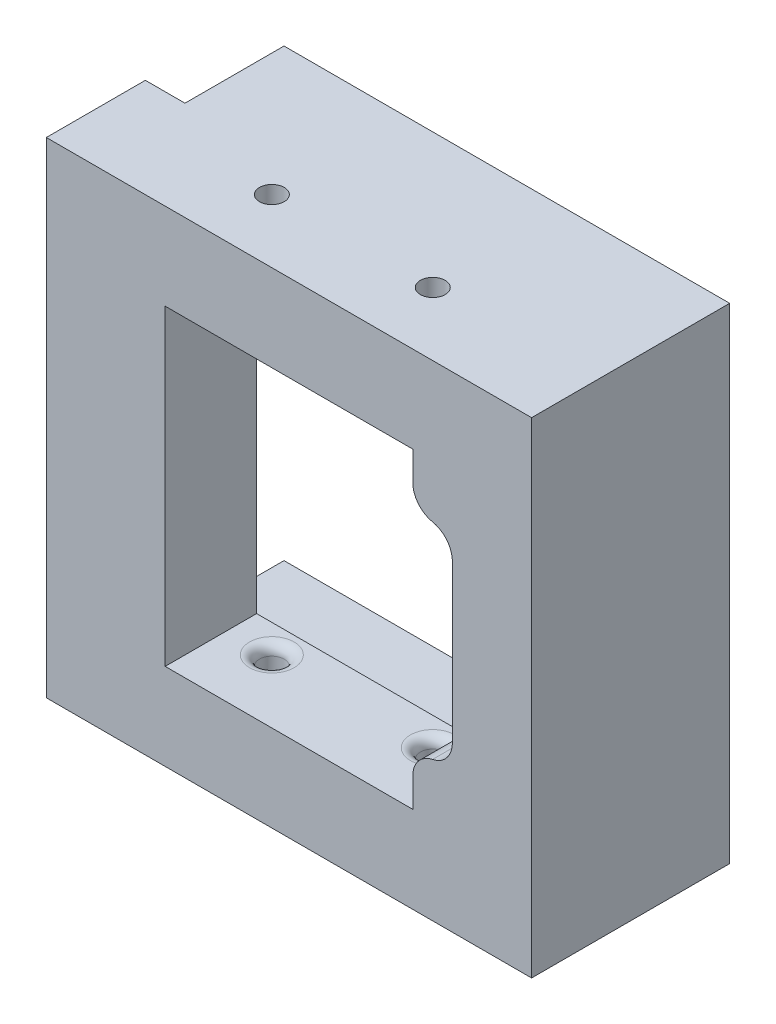
ISO-10303-21;
HEADER;
FILE_DESCRIPTION(('STEP AP214'),'2;1');
FILE_NAME('part.step','',(''),(''),'','','');
FILE_SCHEMA(('AUTOMOTIVE_DESIGN { 1 0 10303 214 1 1 1 1 }'));
ENDSEC;
DATA;
#1=APPLICATION_CONTEXT('core data for automotive mechanical design processes');
#2=APPLICATION_PROTOCOL_DEFINITION('international standard','automotive_design',2000,#1);
#3=PRODUCT_CONTEXT('',#1,'mechanical');
#4=PRODUCT('Part','Part','',(#3));
#5=PRODUCT_RELATED_PRODUCT_CATEGORY('part','',(#4));
#6=PRODUCT_DEFINITION_FORMATION('','',#4);
#7=PRODUCT_DEFINITION_CONTEXT('part definition',#1,'design');
#8=PRODUCT_DEFINITION('design','',#6,#7);
#9=PRODUCT_DEFINITION_SHAPE('','',#8);
#10=(LENGTH_UNIT() NAMED_UNIT(*) SI_UNIT(.MILLI.,.METRE.));
#11=(NAMED_UNIT(*) PLANE_ANGLE_UNIT() SI_UNIT($,.RADIAN.));
#12=(NAMED_UNIT(*) SI_UNIT($,.STERADIAN.) SOLID_ANGLE_UNIT());
#13=UNCERTAINTY_MEASURE_WITH_UNIT(LENGTH_MEASURE(1.E-05),#10,'distance_accuracy_value','');
#14=(GEOMETRIC_REPRESENTATION_CONTEXT(3) GLOBAL_UNCERTAINTY_ASSIGNED_CONTEXT((#13)) GLOBAL_UNIT_ASSIGNED_CONTEXT((#10,
#11,#12)) REPRESENTATION_CONTEXT('',''));
#15=CARTESIAN_POINT('',(0.,0.,0.));
#16=DIRECTION('',(0.,0.,1.));
#17=DIRECTION('',(1.,0.,0.));
#18=AXIS2_PLACEMENT_3D('',#15,#16,#17);
#19=CARTESIAN_POINT('',(0.,28.575,12.7));
#20=DIRECTION('',(0.,0.,-1.));
#21=DIRECTION('',(0.,1.,0.));
#22=AXIS2_PLACEMENT_3D('',#19,#20,#21);
#23=PLANE('',#22);
#24=DIRECTION('',(-1.,0.,0.));
#25=VECTOR('',#24,1.);
#26=CARTESIAN_POINT('',(26.035,31.115,12.7));
#27=LINE('',#26,#25);
#28=CARTESIAN_POINT('',(31.115,31.115,12.7));
#29=VERTEX_POINT('',#28);
#30=CARTESIAN_POINT('',(-31.115,31.115,12.7));
#31=VERTEX_POINT('',#30);
#32=EDGE_CURVE('E402',#29,#31,#27,.T.);
#33=ORIENTED_EDGE('',*,*,#32,.T.);
#34=DIRECTION('',(0.,-1.,0.));
#35=VECTOR('',#34,1.);
#36=CARTESIAN_POINT('',(-31.115,31.115,12.7));
#37=LINE('',#36,#35);
#38=CARTESIAN_POINT('',(-31.115,-31.115,12.7));
#39=VERTEX_POINT('',#38);
#40=EDGE_CURVE('E393',#31,#39,#37,.T.);
#41=ORIENTED_EDGE('',*,*,#40,.T.);
#42=DIRECTION('',(1.,0.,0.));
#43=VECTOR('',#42,1.);
#44=CARTESIAN_POINT('',(-26.035,-31.115,12.7));
#45=LINE('',#44,#43);
#46=CARTESIAN_POINT('',(31.115,-31.115,12.7));
#47=VERTEX_POINT('',#46);
#48=EDGE_CURVE('E398',#39,#47,#45,.T.);
#49=ORIENTED_EDGE('',*,*,#48,.T.);
#50=DIRECTION('',(0.,1.,0.));
#51=VECTOR('',#50,1.);
#52=CARTESIAN_POINT('',(31.115,-31.115,12.7));
#53=LINE('',#52,#51);
#54=EDGE_CURVE('E585',#47,#29,#53,.T.);
#55=ORIENTED_EDGE('',*,*,#54,.T.);
#56=EDGE_LOOP('',(#33,#41,#49,#55));
#57=FACE_BOUND('',#56,.T.);
#58=CARTESIAN_POINT('',(19.0499999999999,16.3022848464236,12.7));
#59=DIRECTION('',(0.,0.,-1.));
#60=DIRECTION('',(-1.,0.,0.));
#61=AXIS2_PLACEMENT_3D('',#58,#59,#60);
#62=CIRCLE('',#61,3.17500000000001);
#63=CARTESIAN_POINT('',(18.4149999999999,13.191432873089,12.7));
#64=VERTEX_POINT('',#63);
#65=CARTESIAN_POINT('',(15.8749999999999,16.3022848464236,12.7));
#66=VERTEX_POINT('',#65);
#67=EDGE_CURVE('E207',#64,#66,#62,.T.);
#68=ORIENTED_EDGE('',*,*,#67,.F.);
#69=CARTESIAN_POINT('',(17.7799999999999,10.0805808997543,12.7));
#70=DIRECTION('',(0.,0.,1.));
#71=DIRECTION('',(1.,0.,0.));
#72=AXIS2_PLACEMENT_3D('',#69,#70,#71);
#73=CIRCLE('',#72,3.175);
#74=CARTESIAN_POINT('',(20.9549999999999,10.0805808997543,12.7));
#75=VERTEX_POINT('',#74);
#76=EDGE_CURVE('E61',#75,#64,#73,.T.);
#77=ORIENTED_EDGE('',*,*,#76,.F.);
#78=DIRECTION('',(0.,1.,0.));
#79=VECTOR('',#78,1.);
#80=CARTESIAN_POINT('',(20.9549999999999,-10.0805808997543,12.7));
#81=LINE('',#80,#79);
#82=CARTESIAN_POINT('',(20.9549999999999,-10.0805808997543,12.7));
#83=VERTEX_POINT('',#82);
#84=EDGE_CURVE('E233',#83,#75,#81,.T.);
#85=ORIENTED_EDGE('',*,*,#84,.F.);
#86=CARTESIAN_POINT('',(17.7799999999999,-10.0805808997543,12.7));
#87=DIRECTION('',(0.,0.,1.));
#88=DIRECTION('',(1.,0.,0.));
#89=AXIS2_PLACEMENT_3D('',#86,#87,#88);
#90=CIRCLE('',#89,3.17500000000001);
#91=CARTESIAN_POINT('',(18.4149999999999,-13.191432873089,12.7));
#92=VERTEX_POINT('',#91);
#93=EDGE_CURVE('E230',#92,#83,#90,.T.);
#94=ORIENTED_EDGE('',*,*,#93,.F.);
#95=CARTESIAN_POINT('',(19.0499999999999,-16.3022848464236,12.7));
#96=DIRECTION('',(0.,0.,-1.));
#97=DIRECTION('',(-1.,0.,0.));
#98=AXIS2_PLACEMENT_3D('',#95,#96,#97);
#99=CIRCLE('',#98,3.175);
#100=CARTESIAN_POINT('',(15.8749999999999,-16.3022848464236,12.7));
#101=VERTEX_POINT('',#100);
#102=EDGE_CURVE('E227',#101,#92,#99,.T.);
#103=ORIENTED_EDGE('',*,*,#102,.F.);
#104=DIRECTION('',(0.,1.,0.));
#105=VECTOR('',#104,1.);
#106=CARTESIAN_POINT('',(15.8749999999999,-20.0024999999999,12.7));
#107=LINE('',#106,#105);
#108=CARTESIAN_POINT('',(15.8749999999999,-20.0024999999999,12.7));
#109=VERTEX_POINT('',#108);
#110=EDGE_CURVE('E224',#109,#101,#107,.T.);
#111=ORIENTED_EDGE('',*,*,#110,.F.);
#112=DIRECTION('',(1.,0.,0.));
#113=VECTOR('',#112,1.);
#114=CARTESIAN_POINT('',(-15.8749999999999,-20.0024999999999,12.7));
#115=LINE('',#114,#113);
#116=CARTESIAN_POINT('',(-15.8749999999999,-20.0024999999999,12.7));
#117=VERTEX_POINT('',#116);
#118=EDGE_CURVE('E221',#117,#109,#115,.T.);
#119=ORIENTED_EDGE('',*,*,#118,.F.);
#120=DIRECTION('',(0.,-1.,0.));
#121=VECTOR('',#120,1.);
#122=CARTESIAN_POINT('',(-15.8749999999999,20.0024999999999,12.7));
#123=LINE('',#122,#121);
#124=CARTESIAN_POINT('',(-15.8749999999999,20.0024999999999,12.7));
#125=VERTEX_POINT('',#124);
#126=EDGE_CURVE('E215',#125,#117,#123,.T.);
#127=ORIENTED_EDGE('',*,*,#126,.F.);
#128=DIRECTION('',(-1.,0.,0.));
#129=VECTOR('',#128,1.);
#130=CARTESIAN_POINT('',(15.8749999999999,20.0024999999999,12.7));
#131=LINE('',#130,#129);
#132=CARTESIAN_POINT('',(15.8749999999999,20.0024999999999,12.7));
#133=VERTEX_POINT('',#132);
#134=EDGE_CURVE('E213',#133,#125,#131,.T.);
#135=ORIENTED_EDGE('',*,*,#134,.F.);
#136=DIRECTION('',(0.,1.,0.));
#137=VECTOR('',#136,1.);
#138=CARTESIAN_POINT('',(15.8749999999999,16.3022848464236,12.7));
#139=LINE('',#138,#137);
#140=EDGE_CURVE('E198',#66,#133,#139,.T.);
#141=ORIENTED_EDGE('',*,*,#140,.F.);
#142=EDGE_LOOP('',(#68,#77,#85,#94,#103,#111,#119,#127,#135,#141));
#143=FACE_BOUND('',#142,.T.);
#144=ADVANCED_FACE('F46',(#57,#143),#23,.F.);
#145=CARTESIAN_POINT('',(26.035,-26.035,0.97289800931212));
#146=DIRECTION('',(0.,0.,1.));
#147=DIRECTION('',(1.,0.,0.));
#148=AXIS2_PLACEMENT_3D('',#145,#146,#147);
#149=PLANE('',#148);
#150=DIRECTION('',(0.,1.,0.));
#151=VECTOR('',#150,1.);
#152=CARTESIAN_POINT('',(-26.035,-23.8399462116059,0.972898009312117));
#153=LINE('',#152,#151);
#154=CARTESIAN_POINT('',(-26.035,26.035,0.97289800931212));
#155=VERTEX_POINT('',#154);
#156=CARTESIAN_POINT('',(-26.035,-26.035,0.97289800931212));
#157=VERTEX_POINT('',#156);
#158=EDGE_CURVE('E302',#155,#157,#153,.F.);
#159=ORIENTED_EDGE('',*,*,#158,.F.);
#160=DIRECTION('',(-1.,0.,0.));
#161=VECTOR('',#160,1.);
#162=CARTESIAN_POINT('',(26.035,26.035,0.97289800931212));
#163=LINE('',#162,#161);
#164=CARTESIAN_POINT('',(26.035,26.035,0.97289800931212));
#165=VERTEX_POINT('',#164);
#166=EDGE_CURVE('E272',#165,#155,#163,.T.);
#167=ORIENTED_EDGE('',*,*,#166,.F.);
#168=DIRECTION('',(0.,1.,0.));
#169=VECTOR('',#168,1.);
#170=CARTESIAN_POINT('',(26.035,-26.035,0.97289800931212));
#171=LINE('',#170,#169);
#172=CARTESIAN_POINT('',(26.035,-26.035,0.97289800931212));
#173=VERTEX_POINT('',#172);
#174=EDGE_CURVE('E260',#173,#165,#171,.T.);
#175=ORIENTED_EDGE('',*,*,#174,.F.);
#176=DIRECTION('',(-1.,0.,0.));
#177=VECTOR('',#176,1.);
#178=CARTESIAN_POINT('',(26.035,-26.035,0.97289800931212));
#179=LINE('',#178,#177);
#180=EDGE_CURVE('E274',#173,#157,#179,.T.);
#181=ORIENTED_EDGE('',*,*,#180,.T.);
#182=EDGE_LOOP('',(#159,#167,#175,#181));
#183=FACE_BOUND('',#182,.T.);
#184=DIRECTION('',(0.,1.,0.));
#185=VECTOR('',#184,1.);
#186=CARTESIAN_POINT('',(20.9549999999999,-26.035,0.97289800931212));
#187=LINE('',#186,#185);
#188=CARTESIAN_POINT('',(20.9549999999999,-10.0805808997543,0.97289800931212));
#189=VERTEX_POINT('',#188);
#190=CARTESIAN_POINT('',(20.9549999999999,10.0805808997543,0.97289800931212));
#191=VERTEX_POINT('',#190);
#192=EDGE_CURVE('E54',#189,#191,#187,.T.);
#193=ORIENTED_EDGE('',*,*,#192,.T.);
#194=CARTESIAN_POINT('',(17.7799999999999,10.0805808997543,0.97289800931212));
#195=DIRECTION('',(0.,0.,1.));
#196=DIRECTION('',(1.,0.,0.));
#197=AXIS2_PLACEMENT_3D('',#194,#195,#196);
#198=CIRCLE('',#197,3.175);
#199=CARTESIAN_POINT('',(18.4149999999999,13.191432873089,0.97289800931212));
#200=VERTEX_POINT('',#199);
#201=EDGE_CURVE('E13',#191,#200,#198,.T.);
#202=ORIENTED_EDGE('',*,*,#201,.T.);
#203=CARTESIAN_POINT('',(19.0499999999999,16.3022848464236,0.97289800931212));
#204=DIRECTION('',(0.,0.,1.));
#205=DIRECTION('',(1.,0.,0.));
#206=AXIS2_PLACEMENT_3D('',#203,#204,#205);
#207=CIRCLE('',#206,3.17500000000001);
#208=CARTESIAN_POINT('',(15.8749999999999,16.3022848464236,0.97289800931212));
#209=VERTEX_POINT('',#208);
#210=EDGE_CURVE('E990',#200,#209,#207,.F.);
#211=ORIENTED_EDGE('',*,*,#210,.T.);
#212=DIRECTION('',(0.,1.,0.));
#213=VECTOR('',#212,1.);
#214=CARTESIAN_POINT('',(15.8749999999999,-26.035,0.97289800931212));
#215=LINE('',#214,#213);
#216=CARTESIAN_POINT('',(15.8749999999999,20.0024999999999,0.97289800931212));
#217=VERTEX_POINT('',#216);
#218=EDGE_CURVE('E201',#209,#217,#215,.T.);
#219=ORIENTED_EDGE('',*,*,#218,.T.);
#220=DIRECTION('',(-1.,0.,0.));
#221=VECTOR('',#220,1.);
#222=CARTESIAN_POINT('',(26.035,20.0024999999999,0.97289800931212));
#223=LINE('',#222,#221);
#224=CARTESIAN_POINT('',(-15.8749999999999,20.0024999999999,0.97289800931212));
#225=VERTEX_POINT('',#224);
#226=EDGE_CURVE('E993',#217,#225,#223,.T.);
#227=ORIENTED_EDGE('',*,*,#226,.T.);
#228=DIRECTION('',(0.,-1.,0.));
#229=VECTOR('',#228,1.);
#230=CARTESIAN_POINT('',(-15.8749999999999,-26.035,0.97289800931212));
#231=LINE('',#230,#229);
#232=CARTESIAN_POINT('',(-15.8749999999999,-20.0024999999999,0.97289800931212));
#233=VERTEX_POINT('',#232);
#234=EDGE_CURVE('E996',#225,#233,#231,.T.);
#235=ORIENTED_EDGE('',*,*,#234,.T.);
#236=DIRECTION('',(1.,0.,0.));
#237=VECTOR('',#236,1.);
#238=CARTESIAN_POINT('',(26.035,-20.0024999999999,0.97289800931212));
#239=LINE('',#238,#237);
#240=CARTESIAN_POINT('',(15.8749999999999,-20.0024999999999,0.97289800931212));
#241=VERTEX_POINT('',#240);
#242=EDGE_CURVE('E999',#233,#241,#239,.T.);
#243=ORIENTED_EDGE('',*,*,#242,.T.);
#244=DIRECTION('',(0.,1.,0.));
#245=VECTOR('',#244,1.);
#246=CARTESIAN_POINT('',(15.8749999999999,-26.035,0.97289800931212));
#247=LINE('',#246,#245);
#248=CARTESIAN_POINT('',(15.8749999999999,-16.3022848464236,0.97289800931212));
#249=VERTEX_POINT('',#248);
#250=EDGE_CURVE('E1002',#241,#249,#247,.T.);
#251=ORIENTED_EDGE('',*,*,#250,.T.);
#252=CARTESIAN_POINT('',(19.0499999999999,-16.3022848464236,0.97289800931212));
#253=DIRECTION('',(0.,0.,1.));
#254=DIRECTION('',(1.,0.,0.));
#255=AXIS2_PLACEMENT_3D('',#252,#253,#254);
#256=CIRCLE('',#255,3.175);
#257=CARTESIAN_POINT('',(18.4149999999999,-13.191432873089,0.97289800931212));
#258=VERTEX_POINT('',#257);
#259=EDGE_CURVE('E1005',#249,#258,#256,.F.);
#260=ORIENTED_EDGE('',*,*,#259,.T.);
#261=CARTESIAN_POINT('',(17.7799999999999,-10.0805808997543,0.97289800931212));
#262=DIRECTION('',(0.,0.,1.));
#263=DIRECTION('',(1.,0.,0.));
#264=AXIS2_PLACEMENT_3D('',#261,#262,#263);
#265=CIRCLE('',#264,3.17500000000001);
#266=EDGE_CURVE('E1008',#258,#189,#265,.T.);
#267=ORIENTED_EDGE('',*,*,#266,.T.);
#268=EDGE_LOOP('',(#193,#202,#211,#219,#227,#235,#243,#251,#260,#267));
#269=FACE_BOUND('',#268,.T.);
#270=ADVANCED_FACE('F350',(#183,#269),#149,.F.);
#271=CARTESIAN_POINT('',(-26.035,-26.035,0.));
#272=DIRECTION('',(1.,0.,0.));
#273=DIRECTION('',(0.,1.,0.));
#274=AXIS2_PLACEMENT_3D('',#271,#272,#273);
#275=PLANE('',#274);
#276=DIRECTION('',(0.,1.,0.));
#277=VECTOR('',#276,1.);
#278=CARTESIAN_POINT('',(-26.035,31.115,-12.7));
#279=LINE('',#278,#277);
#280=CARTESIAN_POINT('',(-26.035,26.035,-12.7));
#281=VERTEX_POINT('',#280);
#282=CARTESIAN_POINT('',(-26.035,31.115,-12.7));
#283=VERTEX_POINT('',#282);
#284=EDGE_CURVE('E285',#281,#283,#279,.T.);
#285=ORIENTED_EDGE('',*,*,#284,.F.);
#286=DIRECTION('',(0.,0.,-1.));
#287=VECTOR('',#286,1.);
#288=CARTESIAN_POINT('',(-26.035,26.035,0.97289800931212));
#289=LINE('',#288,#287);
#290=CARTESIAN_POINT('',(-26.035,26.035,0.));
#291=VERTEX_POINT('',#290);
#292=EDGE_CURVE('E257',#291,#281,#289,.T.);
#293=ORIENTED_EDGE('',*,*,#292,.F.);
#294=DIRECTION('',(0.,-1.,0.));
#295=VECTOR('',#294,1.);
#296=CARTESIAN_POINT('',(-26.035,28.575,0.));
#297=LINE('',#296,#295);
#298=CARTESIAN_POINT('',(-26.035,31.115,0.));
#299=VERTEX_POINT('',#298);
#300=EDGE_CURVE('E397',#299,#291,#297,.T.);
#301=ORIENTED_EDGE('',*,*,#300,.F.);
#302=DIRECTION('',(0.,0.,1.));
#303=VECTOR('',#302,1.);
#304=CARTESIAN_POINT('',(-26.035,31.115,-12.7));
#305=LINE('',#304,#303);
#306=EDGE_CURVE('E289',#283,#299,#305,.T.);
#307=ORIENTED_EDGE('',*,*,#306,.F.);
#308=EDGE_LOOP('',(#285,#293,#301,#307));
#309=FACE_BOUND('',#308,.T.);
#310=ADVANCED_FACE('F1141',(#309),#275,.F.);
#311=CARTESIAN_POINT('',(0.,28.575,0.));
#312=DIRECTION('',(0.,0.,-1.));
#313=DIRECTION('',(0.,1.,0.));
#314=AXIS2_PLACEMENT_3D('',#311,#312,#313);
#315=PLANE('',#314);
#316=DIRECTION('',(-1.,0.,0.));
#317=VECTOR('',#316,1.);
#318=CARTESIAN_POINT('',(26.035,31.115,0.));
#319=LINE('',#318,#317);
#320=CARTESIAN_POINT('',(-31.115,31.115,0.));
#321=VERTEX_POINT('',#320);
#322=EDGE_CURVE('E420',#299,#321,#319,.T.);
#323=ORIENTED_EDGE('',*,*,#322,.F.);
#324=ORIENTED_EDGE('',*,*,#300,.T.);
#325=DIRECTION('',(1.,0.,0.));
#326=VECTOR('',#325,1.);
#327=CARTESIAN_POINT('',(0.,26.035,0.));
#328=LINE('',#327,#326);
#329=CARTESIAN_POINT('',(-27.2697592506757,26.035,0.));
#330=VERTEX_POINT('',#329);
#331=EDGE_CURVE('E296',#291,#330,#328,.F.);
#332=ORIENTED_EDGE('',*,*,#331,.T.);
#333=DIRECTION('',(0.,1.,0.));
#334=VECTOR('',#333,1.);
#335=CARTESIAN_POINT('',(-27.2697592506757,-3.52211333395248,0.));
#336=LINE('',#335,#334);
#337=CARTESIAN_POINT('',(-27.2697592506757,-26.035,0.));
#338=VERTEX_POINT('',#337);
#339=EDGE_CURVE('E419',#330,#338,#336,.F.);
#340=ORIENTED_EDGE('',*,*,#339,.T.);
#341=DIRECTION('',(1.,0.,0.));
#342=VECTOR('',#341,1.);
#343=CARTESIAN_POINT('',(0.,-26.035,0.));
#344=LINE('',#343,#342);
#345=CARTESIAN_POINT('',(-26.035,-26.035,0.));
#346=VERTEX_POINT('',#345);
#347=EDGE_CURVE('E297',#338,#346,#344,.T.);
#348=ORIENTED_EDGE('',*,*,#347,.T.);
#349=DIRECTION('',(0.,1.,0.));
#350=VECTOR('',#349,1.);
#351=CARTESIAN_POINT('',(-26.035,31.115,0.));
#352=LINE('',#351,#350);
#353=CARTESIAN_POINT('',(-26.035,-31.115,0.));
#354=VERTEX_POINT('',#353);
#355=EDGE_CURVE('E271',#354,#346,#352,.T.);
#356=ORIENTED_EDGE('',*,*,#355,.F.);
#357=DIRECTION('',(1.,0.,0.));
#358=VECTOR('',#357,1.);
#359=CARTESIAN_POINT('',(-26.035,-31.115,0.));
#360=LINE('',#359,#358);
#361=CARTESIAN_POINT('',(-31.115,-31.115,0.));
#362=VERTEX_POINT('',#361);
#363=EDGE_CURVE('E580',#362,#354,#360,.T.);
#364=ORIENTED_EDGE('',*,*,#363,.F.);
#365=DIRECTION('',(0.,-1.,0.));
#366=VECTOR('',#365,1.);
#367=CARTESIAN_POINT('',(-31.115,31.115,0.));
#368=LINE('',#367,#366);
#369=EDGE_CURVE('E422',#321,#362,#368,.T.);
#370=ORIENTED_EDGE('',*,*,#369,.F.);
#371=EDGE_LOOP('',(#323,#324,#332,#340,#348,#356,#364,#370));
#372=FACE_BOUND('',#371,.T.);
#373=ADVANCED_FACE('F927',(#372),#315,.T.);
#374=ORIENTED_EDGE('',*,*,#355,.T.);
#375=DIRECTION('',(0.,0.,1.));
#376=VECTOR('',#375,1.);
#377=CARTESIAN_POINT('',(-26.035,-26.035,-12.7));
#378=LINE('',#377,#376);
#379=CARTESIAN_POINT('',(-26.035,-26.035,-12.7));
#380=VERTEX_POINT('',#379);
#381=EDGE_CURVE('E238',#380,#346,#378,.T.);
#382=ORIENTED_EDGE('',*,*,#381,.F.);
#383=CARTESIAN_POINT('',(-26.035,-31.115,-12.7));
#384=VERTEX_POINT('',#383);
#385=EDGE_CURVE('E286',#384,#380,#279,.T.);
#386=ORIENTED_EDGE('',*,*,#385,.F.);
#387=DIRECTION('',(0.,0.,1.));
#388=VECTOR('',#387,1.);
#389=CARTESIAN_POINT('',(-26.035,-31.115,-12.7));
#390=LINE('',#389,#388);
#391=EDGE_CURVE('E294',#384,#354,#390,.T.);
#392=ORIENTED_EDGE('',*,*,#391,.T.);
#393=EDGE_LOOP('',(#374,#382,#386,#392));
#394=FACE_BOUND('',#393,.T.);
#395=ADVANCED_FACE('F931',(#394),#275,.F.);
#396=CARTESIAN_POINT('',(26.035,31.115,0.));
#397=DIRECTION('',(0.,1.,0.));
#398=DIRECTION('',(-1.,0.,0.));
#399=AXIS2_PLACEMENT_3D('',#396,#397,#398);
#400=PLANE('',#399);
#401=CARTESIAN_POINT('',(10.3184635466937,31.115,4.57816839212086));
#402=DIRECTION('',(0.,1.,0.));
#403=DIRECTION('',(-1.,0.,0.));
#404=AXIS2_PLACEMENT_3D('',#401,#402,#403);
#405=CIRCLE('',#404,1.5875);
#406=CARTESIAN_POINT('',(8.7309635466937,31.115,4.57816839212086));
#407=VERTEX_POINT('',#406);
#408=EDGE_CURVE('E1053',#407,#407,#405,.T.);
#409=ORIENTED_EDGE('',*,*,#408,.F.);
#410=EDGE_LOOP('',(#409));
#411=FACE_BOUND('',#410,.T.);
#412=CARTESIAN_POINT('',(-10.3184635466938,31.115,4.57816839212086));
#413=DIRECTION('',(0.,1.,0.));
#414=DIRECTION('',(-1.,0.,0.));
#415=AXIS2_PLACEMENT_3D('',#412,#413,#414);
#416=CIRCLE('',#415,1.58749999999871);
#417=CARTESIAN_POINT('',(-11.9059635466925,31.115,4.57816839212086));
#418=VERTEX_POINT('',#417);
#419=EDGE_CURVE('E1044',#418,#418,#416,.T.);
#420=ORIENTED_EDGE('',*,*,#419,.F.);
#421=EDGE_LOOP('',(#420));
#422=FACE_BOUND('',#421,.T.);
#423=DIRECTION('',(0.,0.,-1.));
#424=VECTOR('',#423,1.);
#425=CARTESIAN_POINT('',(31.115,31.115,0.));
#426=LINE('',#425,#424);
#427=CARTESIAN_POINT('',(31.115,31.115,-12.7));
#428=VERTEX_POINT('',#427);
#429=EDGE_CURVE('E399',#29,#428,#426,.T.);
#430=ORIENTED_EDGE('',*,*,#429,.T.);
#431=DIRECTION('',(1.,0.,0.));
#432=VECTOR('',#431,1.);
#433=CARTESIAN_POINT('',(31.115,31.115,-12.7));
#434=LINE('',#433,#432);
#435=EDGE_CURVE('E277',#283,#428,#434,.T.);
#436=ORIENTED_EDGE('',*,*,#435,.F.);
#437=ORIENTED_EDGE('',*,*,#306,.T.);
#438=ORIENTED_EDGE('',*,*,#322,.T.);
#439=DIRECTION('',(0.,0.,-1.));
#440=VECTOR('',#439,1.);
#441=CARTESIAN_POINT('',(-31.115,31.115,0.));
#442=LINE('',#441,#440);
#443=EDGE_CURVE('E414',#31,#321,#442,.T.);
#444=ORIENTED_EDGE('',*,*,#443,.F.);
#445=ORIENTED_EDGE('',*,*,#32,.F.);
#446=EDGE_LOOP('',(#430,#436,#437,#438,#444,#445));
#447=FACE_BOUND('',#446,.T.);
#448=ADVANCED_FACE('F914',(#411,#422,#447),#400,.T.);
#449=CARTESIAN_POINT('',(31.115,-31.115,0.));
#450=DIRECTION('',(1.,0.,0.));
#451=DIRECTION('',(0.,1.,0.));
#452=AXIS2_PLACEMENT_3D('',#449,#450,#451);
#453=PLANE('',#452);
#454=DIRECTION('',(0.,0.,-1.));
#455=VECTOR('',#454,1.);
#456=CARTESIAN_POINT('',(31.115,-31.115,0.));
#457=LINE('',#456,#455);
#458=CARTESIAN_POINT('',(31.115,-31.115,-12.7));
#459=VERTEX_POINT('',#458);
#460=EDGE_CURVE('E565',#47,#459,#457,.T.);
#461=ORIENTED_EDGE('',*,*,#460,.T.);
#462=DIRECTION('',(0.,-1.,0.));
#463=VECTOR('',#462,1.);
#464=CARTESIAN_POINT('',(31.115,-31.115,-12.7));
#465=LINE('',#464,#463);
#466=EDGE_CURVE('E280',#428,#459,#465,.T.);
#467=ORIENTED_EDGE('',*,*,#466,.F.);
#468=ORIENTED_EDGE('',*,*,#429,.F.);
#469=ORIENTED_EDGE('',*,*,#54,.F.);
#470=EDGE_LOOP('',(#461,#467,#468,#469));
#471=FACE_BOUND('',#470,.T.);
#472=ADVANCED_FACE('F940',(#471),#453,.T.);
#473=CARTESIAN_POINT('',(-26.035,-31.115,0.));
#474=DIRECTION('',(0.,-1.,0.));
#475=DIRECTION('',(1.,0.,0.));
#476=AXIS2_PLACEMENT_3D('',#473,#474,#475);
#477=PLANE('',#476);
#478=CARTESIAN_POINT('',(10.3184635466937,-31.115,4.57816839212086));
#479=DIRECTION('',(0.,1.,0.));
#480=DIRECTION('',(-1.,0.,0.));
#481=AXIS2_PLACEMENT_3D('',#478,#479,#480);
#482=CIRCLE('',#481,1.5875);
#483=CARTESIAN_POINT('',(8.7309635466937,-31.115,4.57816839212086));
#484=VERTEX_POINT('',#483);
#485=EDGE_CURVE('E1038',#484,#484,#482,.T.);
#486=ORIENTED_EDGE('',*,*,#485,.T.);
#487=EDGE_LOOP('',(#486));
#488=FACE_BOUND('',#487,.T.);
#489=CARTESIAN_POINT('',(-10.3184635466938,-31.115,4.57816839212086));
#490=DIRECTION('',(0.,1.,0.));
#491=DIRECTION('',(0.,0.,1.));
#492=AXIS2_PLACEMENT_3D('',#489,#490,#491);
#493=CIRCLE('',#492,1.5875);
#494=CARTESIAN_POINT('',(-10.3184635466938,-31.115,6.16566839212086));
#495=VERTEX_POINT('',#494);
#496=EDGE_CURVE('E1029',#495,#495,#493,.T.);
#497=ORIENTED_EDGE('',*,*,#496,.T.);
#498=EDGE_LOOP('',(#497));
#499=FACE_BOUND('',#498,.T.);
#500=ORIENTED_EDGE('',*,*,#363,.T.);
#501=ORIENTED_EDGE('',*,*,#391,.F.);
#502=DIRECTION('',(-1.,0.,0.));
#503=VECTOR('',#502,1.);
#504=CARTESIAN_POINT('',(-26.035,-31.115,-12.7));
#505=LINE('',#504,#503);
#506=EDGE_CURVE('E283',#459,#384,#505,.T.);
#507=ORIENTED_EDGE('',*,*,#506,.F.);
#508=ORIENTED_EDGE('',*,*,#460,.F.);
#509=ORIENTED_EDGE('',*,*,#48,.F.);
#510=DIRECTION('',(0.,0.,-1.));
#511=VECTOR('',#510,1.);
#512=CARTESIAN_POINT('',(-31.115,-31.115,0.));
#513=LINE('',#512,#511);
#514=EDGE_CURVE('E570',#39,#362,#513,.T.);
#515=ORIENTED_EDGE('',*,*,#514,.T.);
#516=EDGE_LOOP('',(#500,#501,#507,#508,#509,#515));
#517=FACE_BOUND('',#516,.T.);
#518=ADVANCED_FACE('F923',(#488,#499,#517),#477,.T.);
#519=CARTESIAN_POINT('',(26.035,-26.035,0.));
#520=DIRECTION('',(0.,1.,0.));
#521=DIRECTION('',(-1.,0.,0.));
#522=AXIS2_PLACEMENT_3D('',#519,#520,#521);
#523=PLANE('',#522);
#524=CARTESIAN_POINT('',(-27.2697592506757,-26.035,1.27));
#525=DIRECTION('',(0.,1.,0.));
#526=DIRECTION('',(0.,0.,1.));
#527=AXIS2_PLACEMENT_3D('',#524,#525,#526);
#528=CIRCLE('',#527,1.27);
#529=EDGE_CURVE('E558',#157,#338,#528,.T.);
#530=ORIENTED_EDGE('',*,*,#529,.F.);
#531=ORIENTED_EDGE('',*,*,#180,.F.);
#532=DIRECTION('',(0.,0.,1.));
#533=VECTOR('',#532,1.);
#534=CARTESIAN_POINT('',(26.035,-26.035,-12.7));
#535=LINE('',#534,#533);
#536=CARTESIAN_POINT('',(26.035,-26.035,-12.7));
#537=VERTEX_POINT('',#536);
#538=EDGE_CURVE('E256',#537,#173,#535,.T.);
#539=ORIENTED_EDGE('',*,*,#538,.F.);
#540=DIRECTION('',(-1.,0.,0.));
#541=VECTOR('',#540,1.);
#542=CARTESIAN_POINT('',(26.035,-26.035,-12.7));
#543=LINE('',#542,#541);
#544=EDGE_CURVE('E265',#537,#380,#543,.T.);
#545=ORIENTED_EDGE('',*,*,#544,.T.);
#546=ORIENTED_EDGE('',*,*,#381,.T.);
#547=ORIENTED_EDGE('',*,*,#347,.F.);
#548=EDGE_LOOP('',(#530,#531,#539,#545,#546,#547));
#549=FACE_BOUND('',#548,.T.);
#550=ADVANCED_FACE('F1272',(#549),#523,.T.);
#551=CARTESIAN_POINT('',(-26.035,26.035,0.));
#552=DIRECTION('',(0.,-1.,0.));
#553=DIRECTION('',(1.,0.,0.));
#554=AXIS2_PLACEMENT_3D('',#551,#552,#553);
#555=PLANE('',#554);
#556=ORIENTED_EDGE('',*,*,#331,.F.);
#557=ORIENTED_EDGE('',*,*,#292,.T.);
#558=DIRECTION('',(-1.,0.,0.));
#559=VECTOR('',#558,1.);
#560=CARTESIAN_POINT('',(26.035,26.035,-12.7));
#561=LINE('',#560,#559);
#562=CARTESIAN_POINT('',(26.035,26.035,-12.7));
#563=VERTEX_POINT('',#562);
#564=EDGE_CURVE('E268',#563,#281,#561,.T.);
#565=ORIENTED_EDGE('',*,*,#564,.F.);
#566=DIRECTION('',(0.,0.,-1.));
#567=VECTOR('',#566,1.);
#568=CARTESIAN_POINT('',(26.035,26.035,0.97289800931212));
#569=LINE('',#568,#567);
#570=EDGE_CURVE('E263',#165,#563,#569,.T.);
#571=ORIENTED_EDGE('',*,*,#570,.F.);
#572=ORIENTED_EDGE('',*,*,#166,.T.);
#573=CARTESIAN_POINT('',(-27.2697592506757,26.035,1.27));
#574=DIRECTION('',(0.,1.,0.));
#575=DIRECTION('',(0.,0.,1.));
#576=AXIS2_PLACEMENT_3D('',#573,#574,#575);
#577=CIRCLE('',#576,1.27);
#578=EDGE_CURVE('E564',#330,#155,#577,.F.);
#579=ORIENTED_EDGE('',*,*,#578,.F.);
#580=EDGE_LOOP('',(#556,#557,#565,#571,#572,#579));
#581=FACE_BOUND('',#580,.T.);
#582=ADVANCED_FACE('F48',(#581),#555,.T.);
#583=CARTESIAN_POINT('',(-27.2697592506757,-23.8399462116059,1.27));
#584=DIRECTION('',(0.,1.,0.));
#585=DIRECTION('',(0.,0.,1.));
#586=AXIS2_PLACEMENT_3D('',#583,#584,#585);
#587=CYLINDRICAL_SURFACE('',#586,1.27);
#588=ORIENTED_EDGE('',*,*,#339,.F.);
#589=ORIENTED_EDGE('',*,*,#578,.T.);
#590=ORIENTED_EDGE('',*,*,#158,.T.);
#591=ORIENTED_EDGE('',*,*,#529,.T.);
#592=EDGE_LOOP('',(#588,#589,#590,#591));
#593=FACE_BOUND('',#592,.T.);
#594=ADVANCED_FACE('F354',(#593),#587,.T.);
#595=CARTESIAN_POINT('',(-31.115,31.115,0.));
#596=DIRECTION('',(-1.,0.,0.));
#597=DIRECTION('',(0.,-1.,0.));
#598=AXIS2_PLACEMENT_3D('',#595,#596,#597);
#599=PLANE('',#598);
#600=ORIENTED_EDGE('',*,*,#40,.F.);
#601=ORIENTED_EDGE('',*,*,#443,.T.);
#602=ORIENTED_EDGE('',*,*,#369,.T.);
#603=ORIENTED_EDGE('',*,*,#514,.F.);
#604=EDGE_LOOP('',(#600,#601,#602,#603));
#605=FACE_BOUND('',#604,.T.);
#606=ADVANCED_FACE('F919',(#605),#599,.T.);
#607=CARTESIAN_POINT('',(0.,0.,-12.7));
#608=DIRECTION('',(0.,0.,1.));
#609=DIRECTION('',(0.,-1.,0.));
#610=AXIS2_PLACEMENT_3D('',#607,#608,#609);
#611=PLANE('',#610);
#612=DIRECTION('',(0.,-1.,0.));
#613=VECTOR('',#612,1.);
#614=CARTESIAN_POINT('',(26.035,26.035,-12.7));
#615=LINE('',#614,#613);
#616=EDGE_CURVE('E253',#563,#537,#615,.T.);
#617=ORIENTED_EDGE('',*,*,#616,.F.);
#618=ORIENTED_EDGE('',*,*,#564,.T.);
#619=ORIENTED_EDGE('',*,*,#284,.T.);
#620=ORIENTED_EDGE('',*,*,#435,.T.);
#621=ORIENTED_EDGE('',*,*,#466,.T.);
#622=ORIENTED_EDGE('',*,*,#506,.T.);
#623=ORIENTED_EDGE('',*,*,#385,.T.);
#624=ORIENTED_EDGE('',*,*,#544,.F.);
#625=EDGE_LOOP('',(#617,#618,#619,#620,#621,#622,#623,#624));
#626=FACE_BOUND('',#625,.T.);
#627=ADVANCED_FACE('F352',(#626),#611,.F.);
#628=CARTESIAN_POINT('',(26.035,0.,0.));
#629=DIRECTION('',(-1.,0.,0.));
#630=DIRECTION('',(0.,0.,1.));
#631=AXIS2_PLACEMENT_3D('',#628,#629,#630);
#632=PLANE('',#631);
#633=ORIENTED_EDGE('',*,*,#616,.T.);
#634=ORIENTED_EDGE('',*,*,#538,.T.);
#635=ORIENTED_EDGE('',*,*,#174,.T.);
#636=ORIENTED_EDGE('',*,*,#570,.T.);
#637=EDGE_LOOP('',(#633,#634,#635,#636));
#638=FACE_BOUND('',#637,.T.);
#639=ADVANCED_FACE('F1137',(#638),#632,.T.);
#640=CARTESIAN_POINT('',(17.7799999999999,10.0805808997543,-12.7));
#641=DIRECTION('',(0.,0.,1.));
#642=DIRECTION('',(1.,0.,0.));
#643=AXIS2_PLACEMENT_3D('',#640,#641,#642);
#644=CYLINDRICAL_SURFACE('',#643,3.175);
#645=DIRECTION('',(0.,0.,1.));
#646=VECTOR('',#645,1.);
#647=CARTESIAN_POINT('',(20.9549999999999,10.0805808997543,-12.7));
#648=LINE('',#647,#646);
#649=EDGE_CURVE('E236',#191,#75,#648,.T.);
#650=ORIENTED_EDGE('',*,*,#649,.T.);
#651=ORIENTED_EDGE('',*,*,#76,.T.);
#652=DIRECTION('',(0.,0.,1.));
#653=VECTOR('',#652,1.);
#654=CARTESIAN_POINT('',(18.4149999999999,13.191432873089,-12.7));
#655=LINE('',#654,#653);
#656=EDGE_CURVE('E204',#200,#64,#655,.T.);
#657=ORIENTED_EDGE('',*,*,#656,.F.);
#658=ORIENTED_EDGE('',*,*,#201,.F.);
#659=EDGE_LOOP('',(#650,#651,#657,#658));
#660=FACE_BOUND('',#659,.T.);
#661=ADVANCED_FACE('F1110',(#660),#644,.F.);
#662=CARTESIAN_POINT('',(20.9549999999999,-10.0805808997543,-12.7));
#663=DIRECTION('',(1.,0.,0.));
#664=DIRECTION('',(0.,1.,0.));
#665=AXIS2_PLACEMENT_3D('',#662,#663,#664);
#666=PLANE('',#665);
#667=DIRECTION('',(0.,0.,1.));
#668=VECTOR('',#667,1.);
#669=CARTESIAN_POINT('',(20.9549999999999,-10.0805808997543,-12.7));
#670=LINE('',#669,#668);
#671=EDGE_CURVE('E239',#189,#83,#670,.T.);
#672=ORIENTED_EDGE('',*,*,#671,.T.);
#673=ORIENTED_EDGE('',*,*,#84,.T.);
#674=ORIENTED_EDGE('',*,*,#649,.F.);
#675=ORIENTED_EDGE('',*,*,#192,.F.);
#676=EDGE_LOOP('',(#672,#673,#674,#675));
#677=FACE_BOUND('',#676,.T.);
#678=ADVANCED_FACE('F1015',(#677),#666,.F.);
#679=CARTESIAN_POINT('',(17.7799999999999,-10.0805808997543,-12.7));
#680=DIRECTION('',(0.,0.,1.));
#681=DIRECTION('',(1.,0.,0.));
#682=AXIS2_PLACEMENT_3D('',#679,#680,#681);
#683=CYLINDRICAL_SURFACE('',#682,3.17500000000001);
#684=DIRECTION('',(0.,0.,1.));
#685=VECTOR('',#684,1.);
#686=CARTESIAN_POINT('',(18.4149999999999,-13.191432873089,-12.7));
#687=LINE('',#686,#685);
#688=EDGE_CURVE('E241',#258,#92,#687,.T.);
#689=ORIENTED_EDGE('',*,*,#688,.T.);
#690=ORIENTED_EDGE('',*,*,#93,.T.);
#691=ORIENTED_EDGE('',*,*,#671,.F.);
#692=ORIENTED_EDGE('',*,*,#266,.F.);
#693=EDGE_LOOP('',(#689,#690,#691,#692));
#694=FACE_BOUND('',#693,.T.);
#695=ADVANCED_FACE('F1017',(#694),#683,.F.);
#696=CARTESIAN_POINT('',(19.0499999999999,-16.3022848464236,-12.7));
#697=DIRECTION('',(0.,0.,1.));
#698=DIRECTION('',(1.,0.,0.));
#699=AXIS2_PLACEMENT_3D('',#696,#697,#698);
#700=CYLINDRICAL_SURFACE('',#699,3.175);
#701=DIRECTION('',(0.,0.,1.));
#702=VECTOR('',#701,1.);
#703=CARTESIAN_POINT('',(15.8749999999999,-16.3022848464236,-12.7));
#704=LINE('',#703,#702);
#705=EDGE_CURVE('E243',#249,#101,#704,.T.);
#706=ORIENTED_EDGE('',*,*,#705,.T.);
#707=ORIENTED_EDGE('',*,*,#102,.T.);
#708=ORIENTED_EDGE('',*,*,#688,.F.);
#709=ORIENTED_EDGE('',*,*,#259,.F.);
#710=EDGE_LOOP('',(#706,#707,#708,#709));
#711=FACE_BOUND('',#710,.T.);
#712=ADVANCED_FACE('F1113',(#711),#700,.T.);
#713=CARTESIAN_POINT('',(15.8749999999999,-20.0024999999999,-12.7));
#714=DIRECTION('',(1.,0.,0.));
#715=DIRECTION('',(0.,0.,-1.));
#716=AXIS2_PLACEMENT_3D('',#713,#714,#715);
#717=PLANE('',#716);
#718=DIRECTION('',(0.,0.,1.));
#719=VECTOR('',#718,1.);
#720=CARTESIAN_POINT('',(15.8749999999999,-20.0024999999999,-12.7));
#721=LINE('',#720,#719);
#722=EDGE_CURVE('E245',#241,#109,#721,.T.);
#723=ORIENTED_EDGE('',*,*,#722,.T.);
#724=ORIENTED_EDGE('',*,*,#110,.T.);
#725=ORIENTED_EDGE('',*,*,#705,.F.);
#726=ORIENTED_EDGE('',*,*,#250,.F.);
#727=EDGE_LOOP('',(#723,#724,#725,#726));
#728=FACE_BOUND('',#727,.T.);
#729=ADVANCED_FACE('F1116',(#728),#717,.F.);
#730=CARTESIAN_POINT('',(-15.8749999999999,-20.0024999999999,-12.7));
#731=DIRECTION('',(0.,-1.,0.));
#732=DIRECTION('',(1.,0.,0.));
#733=AXIS2_PLACEMENT_3D('',#730,#731,#732);
#734=PLANE('',#733);
#735=CARTESIAN_POINT('',(10.3184635466937,-20.0024999999999,4.57816839212086));
#736=DIRECTION('',(0.,1.,0.));
#737=DIRECTION('',(-1.,0.,0.));
#738=AXIS2_PLACEMENT_3D('',#735,#736,#737);
#739=CIRCLE('',#738,2.85749999999999);
#740=CARTESIAN_POINT('',(7.46096354669371,-20.0024999999999,4.57816839212086));
#741=VERTEX_POINT('',#740);
#742=EDGE_CURVE('E1035',#741,#741,#739,.T.);
#743=ORIENTED_EDGE('',*,*,#742,.F.);
#744=EDGE_LOOP('',(#743));
#745=FACE_BOUND('',#744,.T.);
#746=CARTESIAN_POINT('',(-10.3184635466938,-20.0024999999999,4.57816839212086));
#747=DIRECTION('',(0.,1.,0.));
#748=DIRECTION('',(0.,0.,1.));
#749=AXIS2_PLACEMENT_3D('',#746,#747,#748);
#750=CIRCLE('',#749,2.85750000000001);
#751=CARTESIAN_POINT('',(-10.3184635466938,-20.0024999999999,7.43566839212087));
#752=VERTEX_POINT('',#751);
#753=EDGE_CURVE('E1024',#752,#752,#750,.T.);
#754=ORIENTED_EDGE('',*,*,#753,.F.);
#755=EDGE_LOOP('',(#754));
#756=FACE_BOUND('',#755,.T.);
#757=DIRECTION('',(0.,0.,1.));
#758=VECTOR('',#757,1.);
#759=CARTESIAN_POINT('',(-15.8749999999999,-20.0024999999999,-12.7));
#760=LINE('',#759,#758);
#761=EDGE_CURVE('E247',#233,#117,#760,.T.);
#762=ORIENTED_EDGE('',*,*,#761,.T.);
#763=ORIENTED_EDGE('',*,*,#118,.T.);
#764=ORIENTED_EDGE('',*,*,#722,.F.);
#765=ORIENTED_EDGE('',*,*,#242,.F.);
#766=EDGE_LOOP('',(#762,#763,#764,#765));
#767=FACE_BOUND('',#766,.T.);
#768=ADVANCED_FACE('F1120',(#745,#756,#767),#734,.F.);
#769=CARTESIAN_POINT('',(-15.8749999999999,20.0024999999999,-12.7));
#770=DIRECTION('',(-1.,0.,0.));
#771=DIRECTION('',(0.,-1.,0.));
#772=AXIS2_PLACEMENT_3D('',#769,#770,#771);
#773=PLANE('',#772);
#774=DIRECTION('',(0.,0.,1.));
#775=VECTOR('',#774,1.);
#776=CARTESIAN_POINT('',(-15.8749999999999,20.0024999999999,-12.7));
#777=LINE('',#776,#775);
#778=EDGE_CURVE('E249',#225,#125,#777,.T.);
#779=ORIENTED_EDGE('',*,*,#778,.T.);
#780=ORIENTED_EDGE('',*,*,#126,.T.);
#781=ORIENTED_EDGE('',*,*,#761,.F.);
#782=ORIENTED_EDGE('',*,*,#234,.F.);
#783=EDGE_LOOP('',(#779,#780,#781,#782));
#784=FACE_BOUND('',#783,.T.);
#785=ADVANCED_FACE('F1124',(#784),#773,.F.);
#786=CARTESIAN_POINT('',(15.8749999999999,20.0024999999999,-12.7));
#787=DIRECTION('',(0.,1.,0.));
#788=DIRECTION('',(-1.,0.,0.));
#789=AXIS2_PLACEMENT_3D('',#786,#787,#788);
#790=PLANE('',#789);
#791=CARTESIAN_POINT('',(10.3184635466937,20.0024999999999,4.57816839212086));
#792=DIRECTION('',(0.,1.,0.));
#793=DIRECTION('',(-1.,0.,0.));
#794=AXIS2_PLACEMENT_3D('',#791,#792,#793);
#795=CIRCLE('',#794,2.85749999999997);
#796=CARTESIAN_POINT('',(7.46096354669373,20.0024999999999,4.57816839212086));
#797=VERTEX_POINT('',#796);
#798=EDGE_CURVE('E1056',#797,#797,#795,.T.);
#799=ORIENTED_EDGE('',*,*,#798,.T.);
#800=EDGE_LOOP('',(#799));
#801=FACE_BOUND('',#800,.T.);
#802=CARTESIAN_POINT('',(-10.3184635466938,20.0024999999999,4.57816839212086));
#803=DIRECTION('',(0.,1.,0.));
#804=DIRECTION('',(-1.,0.,0.));
#805=AXIS2_PLACEMENT_3D('',#802,#803,#804);
#806=CIRCLE('',#805,2.85749999999871);
#807=CARTESIAN_POINT('',(-13.1759635466925,20.0024999999999,4.57816839212086));
#808=VERTEX_POINT('',#807);
#809=EDGE_CURVE('E1047',#808,#808,#806,.T.);
#810=ORIENTED_EDGE('',*,*,#809,.T.);
#811=EDGE_LOOP('',(#810));
#812=FACE_BOUND('',#811,.T.);
#813=DIRECTION('',(0.,0.,1.));
#814=VECTOR('',#813,1.);
#815=CARTESIAN_POINT('',(15.8749999999999,20.0024999999999,-12.7));
#816=LINE('',#815,#814);
#817=EDGE_CURVE('E203',#217,#133,#816,.T.);
#818=ORIENTED_EDGE('',*,*,#817,.T.);
#819=ORIENTED_EDGE('',*,*,#134,.T.);
#820=ORIENTED_EDGE('',*,*,#778,.F.);
#821=ORIENTED_EDGE('',*,*,#226,.F.);
#822=EDGE_LOOP('',(#818,#819,#820,#821));
#823=FACE_BOUND('',#822,.T.);
#824=ADVANCED_FACE('F1060',(#801,#812,#823),#790,.F.);
#825=CARTESIAN_POINT('',(15.8749999999999,16.3022848464236,-12.7));
#826=DIRECTION('',(1.,0.,0.));
#827=DIRECTION('',(0.,0.,-1.));
#828=AXIS2_PLACEMENT_3D('',#825,#826,#827);
#829=PLANE('',#828);
#830=DIRECTION('',(0.,0.,1.));
#831=VECTOR('',#830,1.);
#832=CARTESIAN_POINT('',(15.8749999999999,16.3022848464236,-12.7));
#833=LINE('',#832,#831);
#834=EDGE_CURVE('E69',#209,#66,#833,.T.);
#835=ORIENTED_EDGE('',*,*,#834,.T.);
#836=ORIENTED_EDGE('',*,*,#140,.T.);
#837=ORIENTED_EDGE('',*,*,#817,.F.);
#838=ORIENTED_EDGE('',*,*,#218,.F.);
#839=EDGE_LOOP('',(#835,#836,#837,#838));
#840=FACE_BOUND('',#839,.T.);
#841=ADVANCED_FACE('F195',(#840),#829,.F.);
#842=CARTESIAN_POINT('',(19.0499999999999,16.3022848464236,-12.7));
#843=DIRECTION('',(0.,0.,1.));
#844=DIRECTION('',(1.,0.,0.));
#845=AXIS2_PLACEMENT_3D('',#842,#843,#844);
#846=CYLINDRICAL_SURFACE('',#845,3.17500000000001);
#847=ORIENTED_EDGE('',*,*,#656,.T.);
#848=ORIENTED_EDGE('',*,*,#67,.T.);
#849=ORIENTED_EDGE('',*,*,#834,.F.);
#850=ORIENTED_EDGE('',*,*,#210,.F.);
#851=EDGE_LOOP('',(#847,#848,#849,#850));
#852=FACE_BOUND('',#851,.T.);
#853=ADVANCED_FACE('F208',(#852),#846,.T.);
#854=CARTESIAN_POINT('',(-10.3184635466938,-31.115,4.57816839212086));
#855=DIRECTION('',(0.,1.,0.));
#856=DIRECTION('',(0.,0.,1.));
#857=AXIS2_PLACEMENT_3D('',#854,#855,#856);
#858=CYLINDRICAL_SURFACE('',#857,1.58750000000001);
#859=ORIENTED_EDGE('',*,*,#496,.F.);
#860=EDGE_LOOP('',(#859));
#861=FACE_BOUND('',#860,.T.);
#862=CARTESIAN_POINT('',(-10.3184635466938,-21.2724999999999,4.57816839212086));
#863=DIRECTION('',(0.,1.,0.));
#864=DIRECTION('',(0.,0.,1.));
#865=AXIS2_PLACEMENT_3D('',#862,#863,#864);
#866=CIRCLE('',#865,1.58750000000001);
#867=CARTESIAN_POINT('',(-10.3184635466938,-21.2724999999999,6.16566839212087));
#868=VERTEX_POINT('',#867);
#869=EDGE_CURVE('E1022',#868,#868,#866,.T.);
#870=ORIENTED_EDGE('',*,*,#869,.T.);
#871=EDGE_LOOP('',(#870));
#872=FACE_BOUND('',#871,.T.);
#873=ADVANCED_FACE('F1103',(#861,#872),#858,.F.);
#874=CARTESIAN_POINT('',(-10.3184635466938,-21.2724999999999,4.57816839212086));
#875=DIRECTION('',(0.,1.,0.));
#876=DIRECTION('',(0.,0.,1.));
#877=AXIS2_PLACEMENT_3D('',#874,#875,#876);
#878=TOROIDAL_SURFACE('',#877,2.85750000000001,1.27);
#879=ORIENTED_EDGE('',*,*,#869,.F.);
#880=EDGE_LOOP('',(#879));
#881=FACE_BOUND('',#880,.T.);
#882=ORIENTED_EDGE('',*,*,#753,.T.);
#883=EDGE_LOOP('',(#882));
#884=FACE_BOUND('',#883,.T.);
#885=ADVANCED_FACE('F1099',(#881,#884),#878,.T.);
#886=CARTESIAN_POINT('',(10.3184635466937,-31.115,4.57816839212086));
#887=DIRECTION('',(0.,1.,0.));
#888=DIRECTION('',(-1.,0.,0.));
#889=AXIS2_PLACEMENT_3D('',#886,#887,#888);
#890=CYLINDRICAL_SURFACE('',#889,1.58749999999999);
#891=ORIENTED_EDGE('',*,*,#485,.F.);
#892=EDGE_LOOP('',(#891));
#893=FACE_BOUND('',#892,.T.);
#894=CARTESIAN_POINT('',(10.3184635466937,-21.2724999999999,4.57816839212086));
#895=DIRECTION('',(0.,1.,0.));
#896=DIRECTION('',(-1.,0.,0.));
#897=AXIS2_PLACEMENT_3D('',#894,#895,#896);
#898=CIRCLE('',#897,1.58749999999999);
#899=CARTESIAN_POINT('',(8.73096354669371,-21.2724999999999,4.57816839212086));
#900=VERTEX_POINT('',#899);
#901=EDGE_CURVE('E1032',#900,#900,#898,.T.);
#902=ORIENTED_EDGE('',*,*,#901,.T.);
#903=EDGE_LOOP('',(#902));
#904=FACE_BOUND('',#903,.T.);
#905=ADVANCED_FACE('F1095',(#893,#904),#890,.F.);
#906=CARTESIAN_POINT('',(10.3184635466937,-21.2724999999999,4.57816839212086));
#907=DIRECTION('',(0.,1.,0.));
#908=DIRECTION('',(-1.,0.,0.));
#909=AXIS2_PLACEMENT_3D('',#906,#907,#908);
#910=TOROIDAL_SURFACE('',#909,2.85749999999999,1.27);
#911=ORIENTED_EDGE('',*,*,#901,.F.);
#912=EDGE_LOOP('',(#911));
#913=FACE_BOUND('',#912,.T.);
#914=ORIENTED_EDGE('',*,*,#742,.T.);
#915=EDGE_LOOP('',(#914));
#916=FACE_BOUND('',#915,.T.);
#917=ADVANCED_FACE('F1088',(#913,#916),#910,.T.);
#918=CARTESIAN_POINT('',(-10.3184635466938,21.2724999999999,4.57816839212086));
#919=DIRECTION('',(0.,1.,0.));
#920=DIRECTION('',(-1.,0.,0.));
#921=AXIS2_PLACEMENT_3D('',#918,#919,#920);
#922=TOROIDAL_SURFACE('',#921,2.85749999999871,1.27);
#923=ORIENTED_EDGE('',*,*,#809,.F.);
#924=EDGE_LOOP('',(#923));
#925=FACE_BOUND('',#924,.T.);
#926=CARTESIAN_POINT('',(-10.3184635466938,21.2724999999999,4.57816839212086));
#927=DIRECTION('',(0.,1.,0.));
#928=DIRECTION('',(-1.,0.,0.));
#929=AXIS2_PLACEMENT_3D('',#926,#927,#928);
#930=CIRCLE('',#929,1.58749999999871);
#931=CARTESIAN_POINT('',(-11.9059635466925,21.2724999999999,4.57816839212086));
#932=VERTEX_POINT('',#931);
#933=EDGE_CURVE('E1041',#932,#932,#930,.T.);
#934=ORIENTED_EDGE('',*,*,#933,.T.);
#935=EDGE_LOOP('',(#934));
#936=FACE_BOUND('',#935,.T.);
#937=ADVANCED_FACE('F1082',(#925,#936),#922,.T.);
#938=CARTESIAN_POINT('',(-10.3184635466938,20.0024999999999,4.57816839212086));
#939=DIRECTION('',(0.,1.,0.));
#940=DIRECTION('',(-1.,0.,0.));
#941=AXIS2_PLACEMENT_3D('',#938,#939,#940);
#942=CYLINDRICAL_SURFACE('',#941,1.58749999999871);
#943=ORIENTED_EDGE('',*,*,#933,.F.);
#944=EDGE_LOOP('',(#943));
#945=FACE_BOUND('',#944,.T.);
#946=ORIENTED_EDGE('',*,*,#419,.T.);
#947=EDGE_LOOP('',(#946));
#948=FACE_BOUND('',#947,.T.);
#949=ADVANCED_FACE('F1067',(#945,#948),#942,.F.);
#950=CARTESIAN_POINT('',(10.3184635466937,21.2724999999999,4.57816839212086));
#951=DIRECTION('',(0.,1.,0.));
#952=DIRECTION('',(-1.,0.,0.));
#953=AXIS2_PLACEMENT_3D('',#950,#951,#952);
#954=TOROIDAL_SURFACE('',#953,2.85749999999997,1.27);
#955=ORIENTED_EDGE('',*,*,#798,.F.);
#956=EDGE_LOOP('',(#955));
#957=FACE_BOUND('',#956,.T.);
#958=CARTESIAN_POINT('',(10.3184635466937,21.2724999999999,4.57816839212086));
#959=DIRECTION('',(0.,1.,0.));
#960=DIRECTION('',(-1.,0.,0.));
#961=AXIS2_PLACEMENT_3D('',#958,#959,#960);
#962=CIRCLE('',#961,1.58749999999997);
#963=CARTESIAN_POINT('',(8.73096354669373,21.2724999999999,4.57816839212086));
#964=VERTEX_POINT('',#963);
#965=EDGE_CURVE('E1050',#964,#964,#962,.T.);
#966=ORIENTED_EDGE('',*,*,#965,.T.);
#967=EDGE_LOOP('',(#966));
#968=FACE_BOUND('',#967,.T.);
#969=ADVANCED_FACE('F1063',(#957,#968),#954,.T.);
#970=CARTESIAN_POINT('',(10.3184635466937,20.0024999999999,4.57816839212086));
#971=DIRECTION('',(0.,1.,0.));
#972=DIRECTION('',(-1.,0.,0.));
#973=AXIS2_PLACEMENT_3D('',#970,#971,#972);
#974=CYLINDRICAL_SURFACE('',#973,1.58749999999999);
#975=ORIENTED_EDGE('',*,*,#965,.F.);
#976=EDGE_LOOP('',(#975));
#977=FACE_BOUND('',#976,.T.);
#978=ORIENTED_EDGE('',*,*,#408,.T.);
#979=EDGE_LOOP('',(#978));
#980=FACE_BOUND('',#979,.T.);
#981=ADVANCED_FACE('F1066',(#977,#980),#974,.F.);
#982=CLOSED_SHELL('',(#144,#270,#310,#373,#395,#448,#472,#518,#550,#582,#594,#606,#627,#639,
#661,#678,#695,#712,#729,#768,#785,#824,#841,#853,#873,#885,#905,#917,#937,#949,#969,#981));
#983=MANIFOLD_SOLID_BREP('B2',#982);
#984=ADVANCED_BREP_SHAPE_REPRESENTATION('',(#18,#983),#14);
#985=SHAPE_DEFINITION_REPRESENTATION(#9,#984);
ENDSEC;
END-ISO-10303-21;
